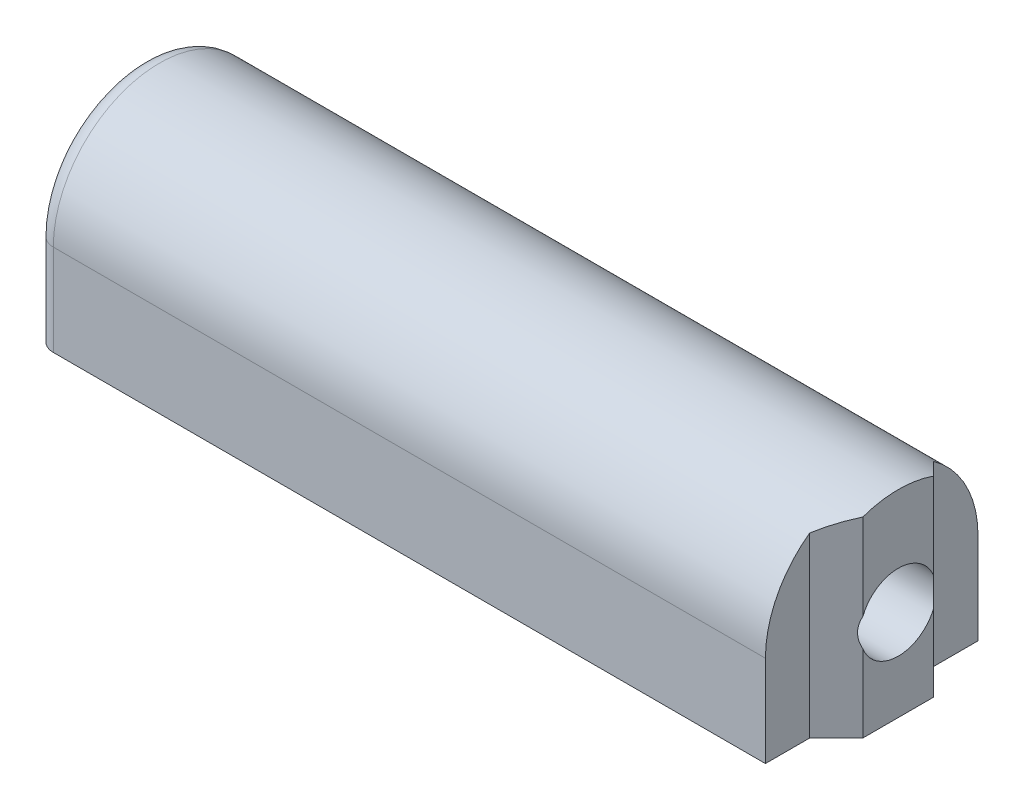
ISO-10303-21;
HEADER;
FILE_DESCRIPTION(('STEP AP214'),'2;1');
FILE_NAME('part.step','',(''),(''),'','','');
FILE_SCHEMA(('AUTOMOTIVE_DESIGN { 1 0 10303 214 1 1 1 1 }'));
ENDSEC;
DATA;
#1=APPLICATION_CONTEXT('core data for automotive mechanical design processes');
#2=APPLICATION_PROTOCOL_DEFINITION('international standard','automotive_design',2000,#1);
#3=PRODUCT_CONTEXT('',#1,'mechanical');
#4=PRODUCT('Part','Part','',(#3));
#5=PRODUCT_RELATED_PRODUCT_CATEGORY('part','',(#4));
#6=PRODUCT_DEFINITION_FORMATION('','',#4);
#7=PRODUCT_DEFINITION_CONTEXT('part definition',#1,'design');
#8=PRODUCT_DEFINITION('design','',#6,#7);
#9=PRODUCT_DEFINITION_SHAPE('','',#8);
#10=(LENGTH_UNIT() NAMED_UNIT(*) SI_UNIT(.MILLI.,.METRE.));
#11=(NAMED_UNIT(*) PLANE_ANGLE_UNIT() SI_UNIT($,.RADIAN.));
#12=(NAMED_UNIT(*) SI_UNIT($,.STERADIAN.) SOLID_ANGLE_UNIT());
#13=UNCERTAINTY_MEASURE_WITH_UNIT(LENGTH_MEASURE(1.E-05),#10,'distance_accuracy_value','');
#14=(GEOMETRIC_REPRESENTATION_CONTEXT(3) GLOBAL_UNCERTAINTY_ASSIGNED_CONTEXT((#13)) GLOBAL_UNIT_ASSIGNED_CONTEXT((#10,
#11,#12)) REPRESENTATION_CONTEXT('',''));
#15=CARTESIAN_POINT('',(0.,0.,0.));
#16=DIRECTION('',(0.,0.,1.));
#17=DIRECTION('',(1.,0.,0.));
#18=AXIS2_PLACEMENT_3D('',#15,#16,#17);
#19=CARTESIAN_POINT('',(0.,0.,12.));
#20=DIRECTION('',(0.,0.,-1.));
#21=DIRECTION('',(-1.,0.,0.));
#22=AXIS2_PLACEMENT_3D('',#19,#20,#21);
#23=PLANE('',#22);
#24=DIRECTION('',(-1.,0.,0.));
#25=VECTOR('',#24,1.);
#26=CARTESIAN_POINT('',(42.700025,5.15,12.));
#27=LINE('',#26,#25);
#28=CARTESIAN_POINT('',(41.2,5.15,12.));
#29=VERTEX_POINT('',#28);
#30=CARTESIAN_POINT('',(1.,5.15,12.));
#31=VERTEX_POINT('',#30);
#32=EDGE_CURVE('E148',#29,#31,#27,.T.);
#33=ORIENTED_EDGE('',*,*,#32,.T.);
#34=DIRECTION('',(0.,-1.,0.));
#35=VECTOR('',#34,1.);
#36=CARTESIAN_POINT('',(1.,0.,12.));
#37=LINE('',#36,#35);
#38=CARTESIAN_POINT('',(1.,0.,12.));
#39=VERTEX_POINT('',#38);
#40=EDGE_CURVE('E11',#31,#39,#37,.T.);
#41=ORIENTED_EDGE('',*,*,#40,.T.);
#42=DIRECTION('',(1.,0.,0.));
#43=VECTOR('',#42,1.);
#44=CARTESIAN_POINT('',(0.,0.,12.));
#45=LINE('',#44,#43);
#46=CARTESIAN_POINT('',(41.2,0.,12.));
#47=VERTEX_POINT('',#46);
#48=EDGE_CURVE('E154',#39,#47,#45,.T.);
#49=ORIENTED_EDGE('',*,*,#48,.T.);
#50=DIRECTION('',(0.,1.,0.));
#51=VECTOR('',#50,1.);
#52=CARTESIAN_POINT('',(41.2,0.,12.));
#53=LINE('',#52,#51);
#54=EDGE_CURVE('E157',#47,#29,#53,.T.);
#55=ORIENTED_EDGE('',*,*,#54,.T.);
#56=EDGE_LOOP('',(#33,#41,#49,#55));
#57=FACE_BOUND('',#56,.T.);
#58=ADVANCED_FACE('F38',(#57),#23,.F.);
#59=CARTESIAN_POINT('',(42.7,-7.15891053163818,8.));
#60=DIRECTION('',(1.,0.,0.));
#61=DIRECTION('',(0.,0.,-1.));
#62=AXIS2_PLACEMENT_3D('',#59,#60,#61);
#63=PLANE('',#62);
#64=CARTESIAN_POINT('',(42.7,5.15,6.));
#65=DIRECTION('',(-1.,0.,0.));
#66=DIRECTION('',(0.,0.,1.));
#67=AXIS2_PLACEMENT_3D('',#64,#65,#66);
#68=CIRCLE('',#67,6.);
#69=CARTESIAN_POINT('',(42.7,10.8068542494924,4.));
#70=VERTEX_POINT('',#69);
#71=CARTESIAN_POINT('',(42.7,10.8068542494924,8.));
#72=VERTEX_POINT('',#71);
#73=EDGE_CURVE('E202',#70,#72,#68,.F.);
#74=ORIENTED_EDGE('',*,*,#73,.T.);
#75=DIRECTION('',(0.,1.,0.));
#76=VECTOR('',#75,1.);
#77=CARTESIAN_POINT('',(42.7,-7.15891053163818,8.));
#78=LINE('',#77,#76);
#79=CARTESIAN_POINT('',(42.7,5.93898669190298,8.));
#80=VERTEX_POINT('',#79);
#81=EDGE_CURVE('E188',#80,#72,#78,.T.);
#82=ORIENTED_EDGE('',*,*,#81,.F.);
#83=CARTESIAN_POINT('',(42.7,5.15,6.));
#84=DIRECTION('',(-1.,0.,0.));
#85=DIRECTION('',(0.,0.,1.));
#86=AXIS2_PLACEMENT_3D('',#83,#84,#85);
#87=CIRCLE('',#86,2.15);
#88=CARTESIAN_POINT('',(42.7,5.93898669190298,4.));
#89=VERTEX_POINT('',#88);
#90=EDGE_CURVE('E197',#80,#89,#87,.T.);
#91=ORIENTED_EDGE('',*,*,#90,.T.);
#92=DIRECTION('',(0.,1.,0.));
#93=VECTOR('',#92,1.);
#94=CARTESIAN_POINT('',(42.7,-7.15891053163818,4.));
#95=LINE('',#94,#93);
#96=EDGE_CURVE('E266',#89,#70,#95,.T.);
#97=ORIENTED_EDGE('',*,*,#96,.T.);
#98=EDGE_LOOP('',(#74,#82,#91,#97));
#99=FACE_BOUND('',#98,.T.);
#100=ADVANCED_FACE('F264',(#99),#63,.T.);
#101=CARTESIAN_POINT('',(41.2,0.,12.));
#102=DIRECTION('',(-1.,0.,0.));
#103=DIRECTION('',(0.,0.,1.));
#104=AXIS2_PLACEMENT_3D('',#101,#102,#103);
#105=PLANE('',#104);
#106=DIRECTION('',(0.,1.,0.));
#107=VECTOR('',#106,1.);
#108=CARTESIAN_POINT('',(41.2,0.,0.));
#109=LINE('',#108,#107);
#110=CARTESIAN_POINT('',(41.2,0.,0.));
#111=VERTEX_POINT('',#110);
#112=CARTESIAN_POINT('',(41.2,5.15,0.));
#113=VERTEX_POINT('',#112);
#114=EDGE_CURVE('E145',#111,#113,#109,.T.);
#115=ORIENTED_EDGE('',*,*,#114,.T.);
#116=CARTESIAN_POINT('',(41.2,5.15,6.));
#117=DIRECTION('',(-1.,0.,0.));
#118=DIRECTION('',(0.,0.,1.));
#119=AXIS2_PLACEMENT_3D('',#116,#117,#118);
#120=CIRCLE('',#119,6.);
#121=CARTESIAN_POINT('',(41.2,10.0233971724045,2.5));
#122=VERTEX_POINT('',#121);
#123=EDGE_CURVE('E129',#113,#122,#120,.F.);
#124=ORIENTED_EDGE('',*,*,#123,.T.);
#125=DIRECTION('',(0.,1.,0.));
#126=VECTOR('',#125,1.);
#127=CARTESIAN_POINT('',(41.2,-7.15891053163818,2.5));
#128=LINE('',#127,#126);
#129=CARTESIAN_POINT('',(41.2,0.,2.5));
#130=VERTEX_POINT('',#129);
#131=EDGE_CURVE('E245',#130,#122,#128,.T.);
#132=ORIENTED_EDGE('',*,*,#131,.F.);
#133=DIRECTION('',(0.,0.,-1.));
#134=VECTOR('',#133,1.);
#135=CARTESIAN_POINT('',(41.2,0.,12.));
#136=LINE('',#135,#134);
#137=EDGE_CURVE('E153',#130,#111,#136,.T.);
#138=ORIENTED_EDGE('',*,*,#137,.T.);
#139=EDGE_LOOP('',(#115,#124,#132,#138));
#140=FACE_BOUND('',#139,.T.);
#141=ADVANCED_FACE('F151',(#140),#105,.F.);
#142=CARTESIAN_POINT('',(0.,0.,12.));
#143=DIRECTION('',(1.,0.,0.));
#144=DIRECTION('',(0.,0.,-1.));
#145=AXIS2_PLACEMENT_3D('',#142,#143,#144);
#146=PLANE('',#145);
#147=CARTESIAN_POINT('',(0.,5.15,6.));
#148=DIRECTION('',(-1.,0.,0.));
#149=DIRECTION('',(0.,0.,1.));
#150=AXIS2_PLACEMENT_3D('',#147,#148,#149);
#151=CIRCLE('',#150,2.15);
#152=CARTESIAN_POINT('',(0.,5.15,8.15));
#153=VERTEX_POINT('',#152);
#154=EDGE_CURVE('E140',#153,#153,#151,.T.);
#155=ORIENTED_EDGE('',*,*,#154,.F.);
#156=EDGE_LOOP('',(#155));
#157=FACE_BOUND('',#156,.T.);
#158=CARTESIAN_POINT('',(0.,5.15,6.));
#159=DIRECTION('',(1.,0.,0.));
#160=DIRECTION('',(0.,0.,-1.));
#161=AXIS2_PLACEMENT_3D('',#158,#159,#160);
#162=CIRCLE('',#161,5.);
#163=CARTESIAN_POINT('',(0.,5.15,11.));
#164=VERTEX_POINT('',#163);
#165=CARTESIAN_POINT('',(0.,5.15,1.));
#166=VERTEX_POINT('',#165);
#167=EDGE_CURVE('E209',#164,#166,#162,.F.);
#168=ORIENTED_EDGE('',*,*,#167,.T.);
#169=DIRECTION('',(0.,-1.,0.));
#170=VECTOR('',#169,1.);
#171=CARTESIAN_POINT('',(0.,0.,1.));
#172=LINE('',#171,#170);
#173=CARTESIAN_POINT('',(0.,0.,1.));
#174=VERTEX_POINT('',#173);
#175=EDGE_CURVE('E211',#166,#174,#172,.T.);
#176=ORIENTED_EDGE('',*,*,#175,.T.);
#177=DIRECTION('',(0.,0.,-1.));
#178=VECTOR('',#177,1.);
#179=CARTESIAN_POINT('',(0.,0.,12.));
#180=LINE('',#179,#178);
#181=CARTESIAN_POINT('',(0.,0.,11.));
#182=VERTEX_POINT('',#181);
#183=EDGE_CURVE('E166',#182,#174,#180,.T.);
#184=ORIENTED_EDGE('',*,*,#183,.F.);
#185=DIRECTION('',(0.,-1.,0.));
#186=VECTOR('',#185,1.);
#187=CARTESIAN_POINT('',(0.,0.,11.));
#188=LINE('',#187,#186);
#189=EDGE_CURVE('E207',#182,#164,#188,.F.);
#190=ORIENTED_EDGE('',*,*,#189,.T.);
#191=EDGE_LOOP('',(#168,#176,#184,#190));
#192=FACE_BOUND('',#191,.T.);
#193=ADVANCED_FACE('F227',(#157,#192),#146,.F.);
#194=CARTESIAN_POINT('',(0.,0.,12.));
#195=DIRECTION('',(0.,1.,0.));
#196=DIRECTION('',(0.,0.,1.));
#197=AXIS2_PLACEMENT_3D('',#194,#195,#196);
#198=PLANE('',#197);
#199=ORIENTED_EDGE('',*,*,#183,.T.);
#200=CARTESIAN_POINT('',(1.,0.,1.));
#201=DIRECTION('',(0.,1.,0.));
#202=DIRECTION('',(0.,0.,1.));
#203=AXIS2_PLACEMENT_3D('',#200,#201,#202);
#204=CIRCLE('',#203,1.);
#205=CARTESIAN_POINT('',(1.,0.,0.));
#206=VERTEX_POINT('',#205);
#207=EDGE_CURVE('E61',#174,#206,#204,.F.);
#208=ORIENTED_EDGE('',*,*,#207,.T.);
#209=DIRECTION('',(1.,0.,0.));
#210=VECTOR('',#209,1.);
#211=CARTESIAN_POINT('',(0.,0.,0.));
#212=LINE('',#211,#210);
#213=EDGE_CURVE('E155',#206,#111,#212,.T.);
#214=ORIENTED_EDGE('',*,*,#213,.T.);
#215=ORIENTED_EDGE('',*,*,#137,.F.);
#216=DIRECTION('',(0.707106781186548,0.,0.707106781186547));
#217=VECTOR('',#216,1.);
#218=CARTESIAN_POINT('',(42.7,0.,4.));
#219=LINE('',#218,#217);
#220=CARTESIAN_POINT('',(42.7,0.,4.));
#221=VERTEX_POINT('',#220);
#222=EDGE_CURVE('E244',#130,#221,#219,.T.);
#223=ORIENTED_EDGE('',*,*,#222,.T.);
#224=DIRECTION('',(0.,0.,1.));
#225=VECTOR('',#224,1.);
#226=CARTESIAN_POINT('',(42.7,0.,8.));
#227=LINE('',#226,#225);
#228=CARTESIAN_POINT('',(42.7,0.,8.));
#229=VERTEX_POINT('',#228);
#230=EDGE_CURVE('E242',#221,#229,#227,.T.);
#231=ORIENTED_EDGE('',*,*,#230,.T.);
#232=DIRECTION('',(-0.707106781186548,0.,0.707106781186548));
#233=VECTOR('',#232,1.);
#234=CARTESIAN_POINT('',(42.7,0.,8.));
#235=LINE('',#234,#233);
#236=CARTESIAN_POINT('',(41.2,0.,9.5));
#237=VERTEX_POINT('',#236);
#238=EDGE_CURVE('E160',#229,#237,#235,.T.);
#239=ORIENTED_EDGE('',*,*,#238,.T.);
#240=EDGE_CURVE('E171',#47,#237,#136,.T.);
#241=ORIENTED_EDGE('',*,*,#240,.F.);
#242=ORIENTED_EDGE('',*,*,#48,.F.);
#243=CARTESIAN_POINT('',(1.,0.,11.));
#244=DIRECTION('',(0.,1.,0.));
#245=DIRECTION('',(0.,0.,1.));
#246=AXIS2_PLACEMENT_3D('',#243,#244,#245);
#247=CIRCLE('',#246,1.);
#248=EDGE_CURVE('E213',#39,#182,#247,.F.);
#249=ORIENTED_EDGE('',*,*,#248,.T.);
#250=EDGE_LOOP('',(#199,#208,#214,#215,#223,#231,#239,#241,#242,#249));
#251=FACE_BOUND('',#250,.T.);
#252=ADVANCED_FACE('F229',(#251),#198,.F.);
#253=DIRECTION('',(0.,1.,0.));
#254=VECTOR('',#253,1.);
#255=CARTESIAN_POINT('',(41.2,-7.15891053163818,9.5));
#256=LINE('',#255,#254);
#257=CARTESIAN_POINT('',(41.2,10.0233971724045,9.5));
#258=VERTEX_POINT('',#257);
#259=EDGE_CURVE('E185',#237,#258,#256,.T.);
#260=ORIENTED_EDGE('',*,*,#259,.T.);
#261=CARTESIAN_POINT('',(41.2,5.15,6.));
#262=DIRECTION('',(-1.,0.,0.));
#263=DIRECTION('',(0.,0.,1.));
#264=AXIS2_PLACEMENT_3D('',#261,#262,#263);
#265=CIRCLE('',#264,6.);
#266=EDGE_CURVE('E205',#258,#29,#265,.F.);
#267=ORIENTED_EDGE('',*,*,#266,.T.);
#268=ORIENTED_EDGE('',*,*,#54,.F.);
#269=ORIENTED_EDGE('',*,*,#240,.T.);
#270=EDGE_LOOP('',(#260,#267,#268,#269));
#271=FACE_BOUND('',#270,.T.);
#272=ADVANCED_FACE('F260',(#271),#105,.F.);
#273=CARTESIAN_POINT('',(0.,0.,0.));
#274=DIRECTION('',(0.,0.,-1.));
#275=DIRECTION('',(-1.,0.,0.));
#276=AXIS2_PLACEMENT_3D('',#273,#274,#275);
#277=PLANE('',#276);
#278=ORIENTED_EDGE('',*,*,#213,.F.);
#279=DIRECTION('',(0.,-1.,0.));
#280=VECTOR('',#279,1.);
#281=CARTESIAN_POINT('',(1.,5.15,0.));
#282=LINE('',#281,#280);
#283=CARTESIAN_POINT('',(1.,5.15,0.));
#284=VERTEX_POINT('',#283);
#285=EDGE_CURVE('E47',#206,#284,#282,.F.);
#286=ORIENTED_EDGE('',*,*,#285,.T.);
#287=DIRECTION('',(-1.,0.,0.));
#288=VECTOR('',#287,1.);
#289=CARTESIAN_POINT('',(42.700025,5.15,0.));
#290=LINE('',#289,#288);
#291=EDGE_CURVE('E133',#113,#284,#290,.T.);
#292=ORIENTED_EDGE('',*,*,#291,.F.);
#293=ORIENTED_EDGE('',*,*,#114,.F.);
#294=EDGE_LOOP('',(#278,#286,#292,#293));
#295=FACE_BOUND('',#294,.T.);
#296=ADVANCED_FACE('F144',(#295),#277,.T.);
#297=CARTESIAN_POINT('',(42.7,-7.15891053163818,4.));
#298=DIRECTION('',(0.707106781186547,0.,-0.707106781186548));
#299=DIRECTION('',(-0.707106781186548,0.,-0.707106781186547));
#300=AXIS2_PLACEMENT_3D('',#297,#298,#299);
#301=PLANE('',#300);
#302=CARTESIAN_POINT('',(44.7,5.15,6.));
#303=DIRECTION('',(0.707106781186547,0.,-0.707106781186548));
#304=DIRECTION('',(-0.707106781186548,0.,-0.707106781186547));
#305=AXIS2_PLACEMENT_3D('',#302,#303,#304);
#306=ELLIPSE('',#305,8.48528137423857,6.);
#307=EDGE_CURVE('E136',#70,#122,#306,.F.);
#308=ORIENTED_EDGE('',*,*,#307,.F.);
#309=ORIENTED_EDGE('',*,*,#96,.F.);
#310=CARTESIAN_POINT('',(44.7,5.15,6.));
#311=DIRECTION('',(0.707106781186547,0.,-0.707106781186548));
#312=DIRECTION('',(-0.707106781186548,0.,-0.707106781186547));
#313=AXIS2_PLACEMENT_3D('',#310,#311,#312);
#314=ELLIPSE('',#313,3.04055915910216,2.15);
#315=CARTESIAN_POINT('',(42.7,4.36101330809702,4.));
#316=VERTEX_POINT('',#315);
#317=EDGE_CURVE('E189',#316,#89,#314,.T.);
#318=ORIENTED_EDGE('',*,*,#317,.F.);
#319=EDGE_CURVE('E247',#221,#316,#95,.T.);
#320=ORIENTED_EDGE('',*,*,#319,.F.);
#321=ORIENTED_EDGE('',*,*,#222,.F.);
#322=ORIENTED_EDGE('',*,*,#131,.T.);
#323=EDGE_LOOP('',(#308,#309,#318,#320,#321,#322));
#324=FACE_BOUND('',#323,.T.);
#325=ADVANCED_FACE('F275',(#324),#301,.T.);
#326=CARTESIAN_POINT('',(42.7,5.15,6.));
#327=DIRECTION('',(-1.,0.,0.));
#328=DIRECTION('',(0.,0.,1.));
#329=AXIS2_PLACEMENT_3D('',#326,#327,#328);
#330=CIRCLE('',#329,2.15);
#331=CARTESIAN_POINT('',(42.7,4.36101330809702,8.));
#332=VERTEX_POINT('',#331);
#333=EDGE_CURVE('E194',#316,#332,#330,.T.);
#334=ORIENTED_EDGE('',*,*,#333,.T.);
#335=EDGE_CURVE('E182',#229,#332,#78,.T.);
#336=ORIENTED_EDGE('',*,*,#335,.F.);
#337=ORIENTED_EDGE('',*,*,#230,.F.);
#338=ORIENTED_EDGE('',*,*,#319,.T.);
#339=EDGE_LOOP('',(#334,#336,#337,#338));
#340=FACE_BOUND('',#339,.T.);
#341=ADVANCED_FACE('F271',(#340),#63,.T.);
#342=CARTESIAN_POINT('',(42.7,-7.15891053163818,8.));
#343=DIRECTION('',(0.707106781186547,0.,0.707106781186547));
#344=DIRECTION('',(0.707106781186548,0.,-0.707106781186548));
#345=AXIS2_PLACEMENT_3D('',#342,#343,#344);
#346=PLANE('',#345);
#347=CARTESIAN_POINT('',(44.7,5.15,6.));
#348=DIRECTION('',(0.707106781186547,0.,0.707106781186547));
#349=DIRECTION('',(-0.707106781186548,0.,0.707106781186548));
#350=AXIS2_PLACEMENT_3D('',#347,#348,#349);
#351=ELLIPSE('',#350,8.48528137423857,6.);
#352=EDGE_CURVE('E193',#258,#72,#351,.F.);
#353=ORIENTED_EDGE('',*,*,#352,.F.);
#354=ORIENTED_EDGE('',*,*,#259,.F.);
#355=ORIENTED_EDGE('',*,*,#238,.F.);
#356=ORIENTED_EDGE('',*,*,#335,.T.);
#357=CARTESIAN_POINT('',(44.7,5.15,6.));
#358=DIRECTION('',(0.707106781186547,0.,0.707106781186547));
#359=DIRECTION('',(-0.707106781186548,0.,0.707106781186548));
#360=AXIS2_PLACEMENT_3D('',#357,#358,#359);
#361=ELLIPSE('',#360,3.04055915910216,2.15);
#362=EDGE_CURVE('E177',#80,#332,#361,.T.);
#363=ORIENTED_EDGE('',*,*,#362,.F.);
#364=ORIENTED_EDGE('',*,*,#81,.T.);
#365=EDGE_LOOP('',(#353,#354,#355,#356,#363,#364));
#366=FACE_BOUND('',#365,.T.);
#367=ADVANCED_FACE('F258',(#366),#346,.T.);
#368=CARTESIAN_POINT('',(42.700025,5.15,6.));
#369=DIRECTION('',(-1.,0.,0.));
#370=DIRECTION('',(0.,0.,1.));
#371=AXIS2_PLACEMENT_3D('',#368,#369,#370);
#372=CYLINDRICAL_SURFACE('',#371,2.15);
#373=ORIENTED_EDGE('',*,*,#317,.T.);
#374=ORIENTED_EDGE('',*,*,#90,.F.);
#375=ORIENTED_EDGE('',*,*,#362,.T.);
#376=ORIENTED_EDGE('',*,*,#333,.F.);
#377=EDGE_LOOP('',(#373,#374,#375,#376));
#378=FACE_BOUND('',#377,.T.);
#379=ORIENTED_EDGE('',*,*,#154,.T.);
#380=EDGE_LOOP('',(#379));
#381=FACE_BOUND('',#380,.T.);
#382=ADVANCED_FACE('F277',(#378,#381),#372,.F.);
#383=CARTESIAN_POINT('',(42.700025,5.15,6.));
#384=DIRECTION('',(-1.,0.,0.));
#385=DIRECTION('',(0.,0.,1.));
#386=AXIS2_PLACEMENT_3D('',#383,#384,#385);
#387=CYLINDRICAL_SURFACE('',#386,6.);
#388=ORIENTED_EDGE('',*,*,#291,.T.);
#389=CARTESIAN_POINT('',(1.,5.15,6.));
#390=DIRECTION('',(1.,0.,0.));
#391=DIRECTION('',(0.,0.,-1.));
#392=AXIS2_PLACEMENT_3D('',#389,#390,#391);
#393=CIRCLE('',#392,6.);
#394=EDGE_CURVE('E201',#284,#31,#393,.T.);
#395=ORIENTED_EDGE('',*,*,#394,.T.);
#396=ORIENTED_EDGE('',*,*,#32,.F.);
#397=ORIENTED_EDGE('',*,*,#266,.F.);
#398=ORIENTED_EDGE('',*,*,#352,.T.);
#399=ORIENTED_EDGE('',*,*,#73,.F.);
#400=ORIENTED_EDGE('',*,*,#307,.T.);
#401=ORIENTED_EDGE('',*,*,#123,.F.);
#402=EDGE_LOOP('',(#388,#395,#396,#397,#398,#399,#400,#401));
#403=FACE_BOUND('',#402,.T.);
#404=ADVANCED_FACE('F131',(#403),#387,.T.);
#405=CARTESIAN_POINT('',(1.,0.,1.));
#406=DIRECTION('',(0.,1.,0.));
#407=DIRECTION('',(0.,0.,1.));
#408=AXIS2_PLACEMENT_3D('',#405,#406,#407);
#409=CYLINDRICAL_SURFACE('',#408,1.);
#410=ORIENTED_EDGE('',*,*,#207,.F.);
#411=ORIENTED_EDGE('',*,*,#175,.F.);
#412=CARTESIAN_POINT('',(1.,5.15,1.));
#413=DIRECTION('',(0.,1.,0.));
#414=DIRECTION('',(0.,0.,1.));
#415=AXIS2_PLACEMENT_3D('',#412,#413,#414);
#416=CIRCLE('',#415,1.);
#417=EDGE_CURVE('E42',#284,#166,#416,.T.);
#418=ORIENTED_EDGE('',*,*,#417,.F.);
#419=ORIENTED_EDGE('',*,*,#285,.F.);
#420=EDGE_LOOP('',(#410,#411,#418,#419));
#421=FACE_BOUND('',#420,.T.);
#422=ADVANCED_FACE('F40',(#421),#409,.T.);
#423=CARTESIAN_POINT('',(1.,0.,11.));
#424=DIRECTION('',(0.,-1.,0.));
#425=DIRECTION('',(0.,0.,-1.));
#426=AXIS2_PLACEMENT_3D('',#423,#424,#425);
#427=CYLINDRICAL_SURFACE('',#426,1.);
#428=ORIENTED_EDGE('',*,*,#248,.F.);
#429=ORIENTED_EDGE('',*,*,#40,.F.);
#430=CARTESIAN_POINT('',(1.,5.15,11.));
#431=DIRECTION('',(0.,1.,0.));
#432=DIRECTION('',(0.,0.,1.));
#433=AXIS2_PLACEMENT_3D('',#430,#431,#432);
#434=CIRCLE('',#433,1.);
#435=EDGE_CURVE('E216',#164,#31,#434,.T.);
#436=ORIENTED_EDGE('',*,*,#435,.F.);
#437=ORIENTED_EDGE('',*,*,#189,.F.);
#438=EDGE_LOOP('',(#428,#429,#436,#437));
#439=FACE_BOUND('',#438,.T.);
#440=ADVANCED_FACE('F232',(#439),#427,.T.);
#441=CARTESIAN_POINT('',(1.,5.15,6.));
#442=DIRECTION('',(1.,0.,0.));
#443=DIRECTION('',(0.,0.,-1.));
#444=AXIS2_PLACEMENT_3D('',#441,#442,#443);
#445=TOROIDAL_SURFACE('',#444,5.,1.);
#446=ORIENTED_EDGE('',*,*,#417,.T.);
#447=ORIENTED_EDGE('',*,*,#167,.F.);
#448=ORIENTED_EDGE('',*,*,#435,.T.);
#449=ORIENTED_EDGE('',*,*,#394,.F.);
#450=EDGE_LOOP('',(#446,#447,#448,#449));
#451=FACE_BOUND('',#450,.T.);
#452=ADVANCED_FACE('F222',(#451),#445,.T.);
#453=CLOSED_SHELL('',(#58,#100,#141,#193,#252,#272,#296,#325,#341,#367,#382,#404,#422,#440,#452));
#454=MANIFOLD_SOLID_BREP('B2',#453);
#455=ADVANCED_BREP_SHAPE_REPRESENTATION('',(#18,#454),#14);
#456=SHAPE_DEFINITION_REPRESENTATION(#9,#455);
ENDSEC;
END-ISO-10303-21;
